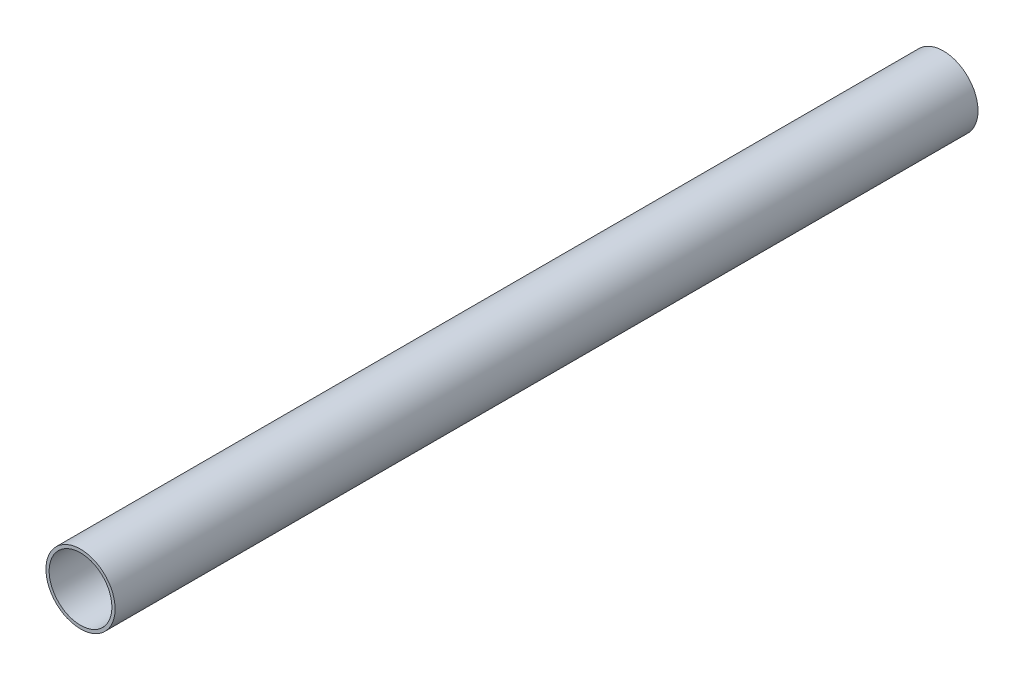
ISO-10303-21;
HEADER;
FILE_DESCRIPTION(('STEP AP214'),'2;1');
FILE_NAME('part.step','',(''),(''),'','','');
FILE_SCHEMA(('AUTOMOTIVE_DESIGN { 1 0 10303 214 1 1 1 1 }'));
ENDSEC;
DATA;
#1=APPLICATION_CONTEXT('core data for automotive mechanical design processes');
#2=APPLICATION_PROTOCOL_DEFINITION('international standard','automotive_design',2000,#1);
#3=PRODUCT_CONTEXT('',#1,'mechanical');
#4=PRODUCT('Part','Part','',(#3));
#5=PRODUCT_RELATED_PRODUCT_CATEGORY('part','',(#4));
#6=PRODUCT_DEFINITION_FORMATION('','',#4);
#7=PRODUCT_DEFINITION_CONTEXT('part definition',#1,'design');
#8=PRODUCT_DEFINITION('design','',#6,#7);
#9=PRODUCT_DEFINITION_SHAPE('','',#8);
#10=(LENGTH_UNIT() NAMED_UNIT(*) SI_UNIT(.MILLI.,.METRE.));
#11=(NAMED_UNIT(*) PLANE_ANGLE_UNIT() SI_UNIT($,.RADIAN.));
#12=(NAMED_UNIT(*) SI_UNIT($,.STERADIAN.) SOLID_ANGLE_UNIT());
#13=UNCERTAINTY_MEASURE_WITH_UNIT(LENGTH_MEASURE(1.E-05),#10,'distance_accuracy_value','');
#14=(GEOMETRIC_REPRESENTATION_CONTEXT(3) GLOBAL_UNCERTAINTY_ASSIGNED_CONTEXT((#13)) GLOBAL_UNIT_ASSIGNED_CONTEXT((#10,
#11,#12)) REPRESENTATION_CONTEXT('',''));
#15=CARTESIAN_POINT('',(0.,0.,0.));
#16=DIRECTION('',(0.,0.,1.));
#17=DIRECTION('',(1.,0.,0.));
#18=AXIS2_PLACEMENT_3D('',#15,#16,#17);
#19=CARTESIAN_POINT('',(0.,0.,275.));
#20=DIRECTION('',(0.,0.,1.));
#21=DIRECTION('',(1.,0.,0.));
#22=AXIS2_PLACEMENT_3D('',#19,#20,#21);
#23=PLANE('',#22);
#24=CARTESIAN_POINT('',(0.,0.,275.));
#25=DIRECTION('',(0.,0.,1.));
#26=DIRECTION('',(1.,0.,0.));
#27=AXIS2_PLACEMENT_3D('',#24,#25,#26);
#28=CIRCLE('',#27,11.0226552142035);
#29=CARTESIAN_POINT('',(11.0226552142035,0.,275.));
#30=VERTEX_POINT('',#29);
#31=EDGE_CURVE('E10',#30,#30,#28,.T.);
#32=ORIENTED_EDGE('',*,*,#31,.T.);
#33=EDGE_LOOP('',(#32));
#34=FACE_BOUND('',#33,.T.);
#35=CARTESIAN_POINT('',(0.,0.,275.));
#36=DIRECTION('',(0.,0.,1.));
#37=DIRECTION('',(1.,0.,0.));
#38=AXIS2_PLACEMENT_3D('',#35,#36,#37);
#39=CIRCLE('',#38,10.);
#40=CARTESIAN_POINT('',(10.,0.,275.));
#41=VERTEX_POINT('',#40);
#42=EDGE_CURVE('E45',#41,#41,#39,.T.);
#43=ORIENTED_EDGE('',*,*,#42,.F.);
#44=EDGE_LOOP('',(#43));
#45=FACE_BOUND('',#44,.T.);
#46=ADVANCED_FACE('F31',(#34,#45),#23,.T.);
#47=CARTESIAN_POINT('',(0.,0.,0.));
#48=DIRECTION('',(0.,0.,1.));
#49=DIRECTION('',(1.,0.,0.));
#50=AXIS2_PLACEMENT_3D('',#47,#48,#49);
#51=PLANE('',#50);
#52=CARTESIAN_POINT('',(0.,0.,0.));
#53=DIRECTION('',(0.,0.,1.));
#54=DIRECTION('',(1.,0.,0.));
#55=AXIS2_PLACEMENT_3D('',#52,#53,#54);
#56=CIRCLE('',#55,11.0226552142035);
#57=CARTESIAN_POINT('',(11.0226552142035,0.,0.));
#58=VERTEX_POINT('',#57);
#59=EDGE_CURVE('E39',#58,#58,#56,.T.);
#60=ORIENTED_EDGE('',*,*,#59,.F.);
#61=EDGE_LOOP('',(#60));
#62=FACE_BOUND('',#61,.T.);
#63=CARTESIAN_POINT('',(0.,0.,0.));
#64=DIRECTION('',(0.,0.,1.));
#65=DIRECTION('',(1.,0.,0.));
#66=AXIS2_PLACEMENT_3D('',#63,#64,#65);
#67=CIRCLE('',#66,10.);
#68=CARTESIAN_POINT('',(10.,0.,0.));
#69=VERTEX_POINT('',#68);
#70=EDGE_CURVE('E35',#69,#69,#67,.F.);
#71=ORIENTED_EDGE('',*,*,#70,.F.);
#72=EDGE_LOOP('',(#71));
#73=FACE_BOUND('',#72,.T.);
#74=ADVANCED_FACE('F54',(#62,#73),#51,.F.);
#75=CARTESIAN_POINT('',(0.,0.,275.));
#76=DIRECTION('',(0.,0.,-1.));
#77=DIRECTION('',(-1.,0.,0.));
#78=AXIS2_PLACEMENT_3D('',#75,#76,#77);
#79=CYLINDRICAL_SURFACE('',#78,11.0226552142035);
#80=ORIENTED_EDGE('',*,*,#31,.F.);
#81=EDGE_LOOP('',(#80));
#82=FACE_BOUND('',#81,.T.);
#83=ORIENTED_EDGE('',*,*,#59,.T.);
#84=EDGE_LOOP('',(#83));
#85=FACE_BOUND('',#84,.T.);
#86=ADVANCED_FACE('F33',(#82,#85),#79,.T.);
#87=CARTESIAN_POINT('',(0.,0.,275.));
#88=DIRECTION('',(0.,0.,-1.));
#89=DIRECTION('',(-1.,0.,0.));
#90=AXIS2_PLACEMENT_3D('',#87,#88,#89);
#91=CYLINDRICAL_SURFACE('',#90,10.);
#92=ORIENTED_EDGE('',*,*,#42,.T.);
#93=EDGE_LOOP('',(#92));
#94=FACE_BOUND('',#93,.T.);
#95=ORIENTED_EDGE('',*,*,#70,.T.);
#96=EDGE_LOOP('',(#95));
#97=FACE_BOUND('',#96,.T.);
#98=ADVANCED_FACE('F52',(#94,#97),#91,.F.);
#99=CLOSED_SHELL('',(#46,#74,#86,#98));
#100=MANIFOLD_SOLID_BREP('B2',#99);
#101=ADVANCED_BREP_SHAPE_REPRESENTATION('',(#18,#100),#14);
#102=SHAPE_DEFINITION_REPRESENTATION(#9,#101);
ENDSEC;
END-ISO-10303-21;
